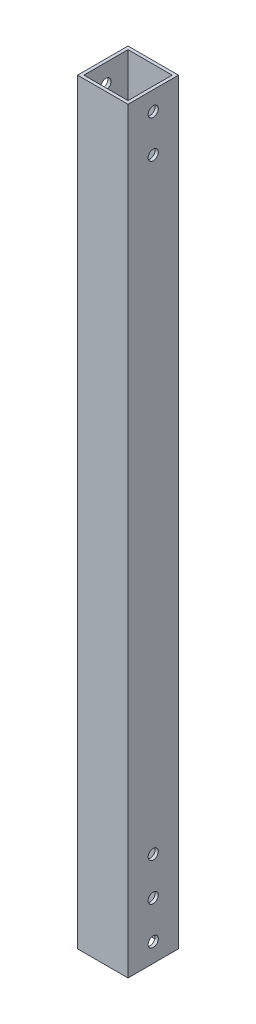
ISO-10303-21;
HEADER;
FILE_DESCRIPTION(('STEP AP214'),'2;1');
FILE_NAME('part.step','',(''),(''),'','','');
FILE_SCHEMA(('AUTOMOTIVE_DESIGN { 1 0 10303 214 1 1 1 1 }'));
ENDSEC;
DATA;
#1=APPLICATION_CONTEXT('core data for automotive mechanical design processes');
#2=APPLICATION_PROTOCOL_DEFINITION('international standard','automotive_design',2000,#1);
#3=PRODUCT_CONTEXT('',#1,'mechanical');
#4=PRODUCT('Part','Part','',(#3));
#5=PRODUCT_RELATED_PRODUCT_CATEGORY('part','',(#4));
#6=PRODUCT_DEFINITION_FORMATION('','',#4);
#7=PRODUCT_DEFINITION_CONTEXT('part definition',#1,'design');
#8=PRODUCT_DEFINITION('design','',#6,#7);
#9=PRODUCT_DEFINITION_SHAPE('','',#8);
#10=(LENGTH_UNIT() NAMED_UNIT(*) SI_UNIT(.MILLI.,.METRE.));
#11=(NAMED_UNIT(*) PLANE_ANGLE_UNIT() SI_UNIT($,.RADIAN.));
#12=(NAMED_UNIT(*) SI_UNIT($,.STERADIAN.) SOLID_ANGLE_UNIT());
#13=UNCERTAINTY_MEASURE_WITH_UNIT(LENGTH_MEASURE(1.E-05),#10,'distance_accuracy_value','');
#14=(GEOMETRIC_REPRESENTATION_CONTEXT(3) GLOBAL_UNCERTAINTY_ASSIGNED_CONTEXT((#13)) GLOBAL_UNIT_ASSIGNED_CONTEXT((#10,
#11,#12)) REPRESENTATION_CONTEXT('',''));
#15=CARTESIAN_POINT('',(0.,0.,0.));
#16=DIRECTION('',(0.,0.,1.));
#17=DIRECTION('',(1.,0.,0.));
#18=AXIS2_PLACEMENT_3D('',#15,#16,#17);
#19=CARTESIAN_POINT('',(12.7,47.625,0.));
#20=DIRECTION('',(-1.,0.,0.));
#21=DIRECTION('',(0.,0.,1.));
#22=AXIS2_PLACEMENT_3D('',#19,#20,#21);
#23=CYLINDRICAL_SURFACE('',#22,2.5527);
#24=CARTESIAN_POINT('',(-11.1125,47.625,0.));
#25=DIRECTION('',(1.,0.,0.));
#26=DIRECTION('',(0.,0.,-1.));
#27=AXIS2_PLACEMENT_3D('',#24,#25,#26);
#28=CIRCLE('',#27,2.5527);
#29=CARTESIAN_POINT('',(-11.1125,47.625,-2.5527));
#30=VERTEX_POINT('',#29);
#31=EDGE_CURVE('E222',#30,#30,#28,.T.);
#32=ORIENTED_EDGE('',*,*,#31,.T.);
#33=EDGE_LOOP('',(#32));
#34=FACE_BOUND('',#33,.T.);
#35=CARTESIAN_POINT('',(-12.7,47.625,0.));
#36=DIRECTION('',(-1.,0.,0.));
#37=DIRECTION('',(0.,0.,1.));
#38=AXIS2_PLACEMENT_3D('',#35,#36,#37);
#39=CIRCLE('',#38,2.5527);
#40=CARTESIAN_POINT('',(-12.7,47.625,2.5527));
#41=VERTEX_POINT('',#40);
#42=EDGE_CURVE('E198',#41,#41,#39,.T.);
#43=ORIENTED_EDGE('',*,*,#42,.T.);
#44=EDGE_LOOP('',(#43));
#45=FACE_BOUND('',#44,.T.);
#46=ADVANCED_FACE('F50',(#34,#45),#23,.F.);
#47=CARTESIAN_POINT('',(12.7,47.625,0.));
#48=DIRECTION('',(-1.,0.,0.));
#49=DIRECTION('',(0.,0.,1.));
#50=AXIS2_PLACEMENT_3D('',#47,#48,#49);
#51=CYLINDRICAL_SURFACE('',#50,2.5527);
#52=CARTESIAN_POINT('',(11.1125,47.625,0.));
#53=DIRECTION('',(-1.,0.,0.));
#54=DIRECTION('',(0.,0.,1.));
#55=AXIS2_PLACEMENT_3D('',#52,#53,#54);
#56=CIRCLE('',#55,2.5527);
#57=CARTESIAN_POINT('',(11.1125,47.625,2.5527));
#58=VERTEX_POINT('',#57);
#59=EDGE_CURVE('E233',#58,#58,#56,.T.);
#60=ORIENTED_EDGE('',*,*,#59,.T.);
#61=EDGE_LOOP('',(#60));
#62=FACE_BOUND('',#61,.T.);
#63=CARTESIAN_POINT('',(12.7,47.625,0.));
#64=DIRECTION('',(-1.,0.,0.));
#65=DIRECTION('',(0.,0.,1.));
#66=AXIS2_PLACEMENT_3D('',#63,#64,#65);
#67=CIRCLE('',#66,2.5527);
#68=CARTESIAN_POINT('',(12.7,47.625,2.5527));
#69=VERTEX_POINT('',#68);
#70=EDGE_CURVE('E374',#69,#69,#67,.T.);
#71=ORIENTED_EDGE('',*,*,#70,.F.);
#72=EDGE_LOOP('',(#71));
#73=FACE_BOUND('',#72,.T.);
#74=ADVANCED_FACE('F52',(#62,#73),#51,.F.);
#75=CARTESIAN_POINT('',(12.7,28.575,0.));
#76=DIRECTION('',(-1.,0.,0.));
#77=DIRECTION('',(0.,0.,1.));
#78=AXIS2_PLACEMENT_3D('',#75,#76,#77);
#79=CYLINDRICAL_SURFACE('',#78,2.5527);
#80=CARTESIAN_POINT('',(-11.1125,28.575,0.));
#81=DIRECTION('',(1.,0.,0.));
#82=DIRECTION('',(0.,0.,-1.));
#83=AXIS2_PLACEMENT_3D('',#80,#81,#82);
#84=CIRCLE('',#83,2.5527);
#85=CARTESIAN_POINT('',(-11.1125,28.575,-2.5527));
#86=VERTEX_POINT('',#85);
#87=EDGE_CURVE('E225',#86,#86,#84,.T.);
#88=ORIENTED_EDGE('',*,*,#87,.T.);
#89=EDGE_LOOP('',(#88));
#90=FACE_BOUND('',#89,.T.);
#91=CARTESIAN_POINT('',(-12.7,28.575,0.));
#92=DIRECTION('',(-1.,0.,0.));
#93=DIRECTION('',(0.,0.,1.));
#94=AXIS2_PLACEMENT_3D('',#91,#92,#93);
#95=CIRCLE('',#94,2.5527);
#96=CARTESIAN_POINT('',(-12.7,28.575,2.5527));
#97=VERTEX_POINT('',#96);
#98=EDGE_CURVE('E212',#97,#97,#95,.T.);
#99=ORIENTED_EDGE('',*,*,#98,.T.);
#100=EDGE_LOOP('',(#99));
#101=FACE_BOUND('',#100,.T.);
#102=ADVANCED_FACE('F275',(#90,#101),#79,.F.);
#103=CARTESIAN_POINT('',(12.7,9.525,0.));
#104=DIRECTION('',(-1.,0.,0.));
#105=DIRECTION('',(0.,0.,1.));
#106=AXIS2_PLACEMENT_3D('',#103,#104,#105);
#107=CYLINDRICAL_SURFACE('',#106,2.5527);
#108=CARTESIAN_POINT('',(-11.1125,9.525,0.));
#109=DIRECTION('',(1.,0.,0.));
#110=DIRECTION('',(0.,0.,-1.));
#111=AXIS2_PLACEMENT_3D('',#108,#109,#110);
#112=CIRCLE('',#111,2.5527);
#113=CARTESIAN_POINT('',(-11.1125,9.525,-2.5527));
#114=VERTEX_POINT('',#113);
#115=EDGE_CURVE('E228',#114,#114,#112,.T.);
#116=ORIENTED_EDGE('',*,*,#115,.T.);
#117=EDGE_LOOP('',(#116));
#118=FACE_BOUND('',#117,.T.);
#119=CARTESIAN_POINT('',(-12.7,9.525,0.));
#120=DIRECTION('',(-1.,0.,0.));
#121=DIRECTION('',(0.,0.,1.));
#122=AXIS2_PLACEMENT_3D('',#119,#120,#121);
#123=CIRCLE('',#122,2.5527);
#124=CARTESIAN_POINT('',(-12.7,9.525,2.5527));
#125=VERTEX_POINT('',#124);
#126=EDGE_CURVE('E215',#125,#125,#123,.T.);
#127=ORIENTED_EDGE('',*,*,#126,.T.);
#128=EDGE_LOOP('',(#127));
#129=FACE_BOUND('',#128,.T.);
#130=ADVANCED_FACE('F283',(#118,#129),#107,.F.);
#131=CARTESIAN_POINT('',(12.7,28.575,0.));
#132=DIRECTION('',(-1.,0.,0.));
#133=DIRECTION('',(0.,0.,1.));
#134=AXIS2_PLACEMENT_3D('',#131,#132,#133);
#135=CYLINDRICAL_SURFACE('',#134,2.5527);
#136=CARTESIAN_POINT('',(11.1125,28.575,0.));
#137=DIRECTION('',(-1.,0.,0.));
#138=DIRECTION('',(0.,0.,1.));
#139=AXIS2_PLACEMENT_3D('',#136,#137,#138);
#140=CIRCLE('',#139,2.5527);
#141=CARTESIAN_POINT('',(11.1125,28.575,2.5527));
#142=VERTEX_POINT('',#141);
#143=EDGE_CURVE('E54',#142,#142,#140,.T.);
#144=ORIENTED_EDGE('',*,*,#143,.T.);
#145=EDGE_LOOP('',(#144));
#146=FACE_BOUND('',#145,.T.);
#147=CARTESIAN_POINT('',(12.7,28.575,0.));
#148=DIRECTION('',(-1.,0.,0.));
#149=DIRECTION('',(0.,0.,1.));
#150=AXIS2_PLACEMENT_3D('',#147,#148,#149);
#151=CIRCLE('',#150,2.5527);
#152=CARTESIAN_POINT('',(12.7,28.575,2.5527));
#153=VERTEX_POINT('',#152);
#154=EDGE_CURVE('E201',#153,#153,#151,.T.);
#155=ORIENTED_EDGE('',*,*,#154,.F.);
#156=EDGE_LOOP('',(#155));
#157=FACE_BOUND('',#156,.T.);
#158=ADVANCED_FACE('F244',(#146,#157),#135,.F.);
#159=CARTESIAN_POINT('',(12.7,9.525,0.));
#160=DIRECTION('',(-1.,0.,0.));
#161=DIRECTION('',(0.,0.,1.));
#162=AXIS2_PLACEMENT_3D('',#159,#160,#161);
#163=CYLINDRICAL_SURFACE('',#162,2.5527);
#164=CARTESIAN_POINT('',(11.1125,9.525,0.));
#165=DIRECTION('',(-1.,0.,0.));
#166=DIRECTION('',(0.,0.,1.));
#167=AXIS2_PLACEMENT_3D('',#164,#165,#166);
#168=CIRCLE('',#167,2.5527);
#169=CARTESIAN_POINT('',(11.1125,9.525,2.5527));
#170=VERTEX_POINT('',#169);
#171=EDGE_CURVE('E11',#170,#170,#168,.T.);
#172=ORIENTED_EDGE('',*,*,#171,.T.);
#173=EDGE_LOOP('',(#172));
#174=FACE_BOUND('',#173,.T.);
#175=CARTESIAN_POINT('',(12.7,9.525,0.));
#176=DIRECTION('',(-1.,0.,0.));
#177=DIRECTION('',(0.,0.,1.));
#178=AXIS2_PLACEMENT_3D('',#175,#176,#177);
#179=CIRCLE('',#178,2.5527);
#180=CARTESIAN_POINT('',(12.7,9.525,2.5527));
#181=VERTEX_POINT('',#180);
#182=EDGE_CURVE('E192',#181,#181,#179,.T.);
#183=ORIENTED_EDGE('',*,*,#182,.F.);
#184=EDGE_LOOP('',(#183));
#185=FACE_BOUND('',#184,.T.);
#186=ADVANCED_FACE('F251',(#174,#185),#163,.F.);
#187=CARTESIAN_POINT('',(11.1125,762.,-11.1125));
#188=DIRECTION('',(-1.,0.,0.));
#189=DIRECTION('',(0.,1.,0.));
#190=AXIS2_PLACEMENT_3D('',#187,#188,#189);
#191=PLANE('',#190);
#192=CARTESIAN_POINT('',(11.1125,371.475,0.));
#193=DIRECTION('',(-1.,0.,0.));
#194=DIRECTION('',(0.,0.,1.));
#195=AXIS2_PLACEMENT_3D('',#192,#193,#194);
#196=CIRCLE('',#195,2.55269999999997);
#197=CARTESIAN_POINT('',(11.1125,371.475,2.55269999999997));
#198=VERTEX_POINT('',#197);
#199=EDGE_CURVE('E403',#198,#198,#196,.T.);
#200=ORIENTED_EDGE('',*,*,#199,.F.);
#201=EDGE_LOOP('',(#200));
#202=FACE_BOUND('',#201,.T.);
#203=CARTESIAN_POINT('',(11.1125,352.552,0.));
#204=DIRECTION('',(-1.,0.,0.));
#205=DIRECTION('',(0.,0.,1.));
#206=AXIS2_PLACEMENT_3D('',#203,#204,#205);
#207=CIRCLE('',#206,2.55269999999997);
#208=CARTESIAN_POINT('',(11.1125,352.552,2.55269999999997));
#209=VERTEX_POINT('',#208);
#210=EDGE_CURVE('E408',#209,#209,#207,.T.);
#211=ORIENTED_EDGE('',*,*,#210,.F.);
#212=EDGE_LOOP('',(#211));
#213=FACE_BOUND('',#212,.T.);
#214=DIRECTION('',(0.,0.,1.));
#215=VECTOR('',#214,1.);
#216=CARTESIAN_POINT('',(11.1125,381.,-11.1125));
#217=LINE('',#216,#215);
#218=CARTESIAN_POINT('',(11.1125,381.,-11.1125));
#219=VERTEX_POINT('',#218);
#220=CARTESIAN_POINT('',(11.1125,381.,11.1125));
#221=VERTEX_POINT('',#220);
#222=EDGE_CURVE('E397',#219,#221,#217,.T.);
#223=ORIENTED_EDGE('',*,*,#222,.F.);
#224=DIRECTION('',(0.,-1.,0.));
#225=VECTOR('',#224,1.);
#226=CARTESIAN_POINT('',(11.1125,762.,-11.1125));
#227=LINE('',#226,#225);
#228=CARTESIAN_POINT('',(11.1125,0.,-11.1125));
#229=VERTEX_POINT('',#228);
#230=EDGE_CURVE('E209',#219,#229,#227,.T.);
#231=ORIENTED_EDGE('',*,*,#230,.T.);
#232=DIRECTION('',(0.,0.,-1.));
#233=VECTOR('',#232,1.);
#234=CARTESIAN_POINT('',(11.1125,0.,-11.1125));
#235=LINE('',#234,#233);
#236=CARTESIAN_POINT('',(11.1125,0.,11.1125));
#237=VERTEX_POINT('',#236);
#238=EDGE_CURVE('E350',#237,#229,#235,.T.);
#239=ORIENTED_EDGE('',*,*,#238,.F.);
#240=DIRECTION('',(0.,-1.,0.));
#241=VECTOR('',#240,1.);
#242=CARTESIAN_POINT('',(11.1125,762.,11.1125));
#243=LINE('',#242,#241);
#244=EDGE_CURVE('E231',#221,#237,#243,.T.);
#245=ORIENTED_EDGE('',*,*,#244,.F.);
#246=EDGE_LOOP('',(#223,#231,#239,#245));
#247=FACE_BOUND('',#246,.T.);
#248=ORIENTED_EDGE('',*,*,#171,.F.);
#249=EDGE_LOOP('',(#248));
#250=FACE_BOUND('',#249,.T.);
#251=ORIENTED_EDGE('',*,*,#143,.F.);
#252=EDGE_LOOP('',(#251));
#253=FACE_BOUND('',#252,.T.);
#254=ORIENTED_EDGE('',*,*,#59,.F.);
#255=EDGE_LOOP('',(#254));
#256=FACE_BOUND('',#255,.T.);
#257=ADVANCED_FACE('F247',(#202,#213,#247,#250,#253,#256),#191,.T.);
#258=CARTESIAN_POINT('',(-11.1125,762.,11.1125));
#259=DIRECTION('',(0.,0.,-1.));
#260=DIRECTION('',(0.,-1.,0.));
#261=AXIS2_PLACEMENT_3D('',#258,#259,#260);
#262=PLANE('',#261);
#263=DIRECTION('',(-1.,0.,0.));
#264=VECTOR('',#263,1.);
#265=CARTESIAN_POINT('',(-11.1125,381.,11.1125));
#266=LINE('',#265,#264);
#267=CARTESIAN_POINT('',(-11.1125,381.,11.1125));
#268=VERTEX_POINT('',#267);
#269=EDGE_CURVE('E338',#221,#268,#266,.T.);
#270=ORIENTED_EDGE('',*,*,#269,.F.);
#271=ORIENTED_EDGE('',*,*,#244,.T.);
#272=DIRECTION('',(1.,0.,0.));
#273=VECTOR('',#272,1.);
#274=CARTESIAN_POINT('',(-11.1125,0.,11.1125));
#275=LINE('',#274,#273);
#276=CARTESIAN_POINT('',(-11.1125,0.,11.1125));
#277=VERTEX_POINT('',#276);
#278=EDGE_CURVE('E344',#277,#237,#275,.T.);
#279=ORIENTED_EDGE('',*,*,#278,.F.);
#280=DIRECTION('',(0.,-1.,0.));
#281=VECTOR('',#280,1.);
#282=CARTESIAN_POINT('',(-11.1125,762.,11.1125));
#283=LINE('',#282,#281);
#284=EDGE_CURVE('E208',#268,#277,#283,.T.);
#285=ORIENTED_EDGE('',*,*,#284,.F.);
#286=EDGE_LOOP('',(#270,#271,#279,#285));
#287=FACE_BOUND('',#286,.T.);
#288=ADVANCED_FACE('F250',(#287),#262,.T.);
#289=CARTESIAN_POINT('',(-11.1125,762.,-11.1125));
#290=DIRECTION('',(1.,0.,0.));
#291=DIRECTION('',(0.,0.,-1.));
#292=AXIS2_PLACEMENT_3D('',#289,#290,#291);
#293=PLANE('',#292);
#294=CARTESIAN_POINT('',(-11.1125,371.475,0.));
#295=DIRECTION('',(1.,0.,0.));
#296=DIRECTION('',(0.,0.,-1.));
#297=AXIS2_PLACEMENT_3D('',#294,#295,#296);
#298=CIRCLE('',#297,2.55269999999997);
#299=CARTESIAN_POINT('',(-11.1125,371.475,-2.55269999999997));
#300=VERTEX_POINT('',#299);
#301=EDGE_CURVE('E324',#300,#300,#298,.T.);
#302=ORIENTED_EDGE('',*,*,#301,.F.);
#303=EDGE_LOOP('',(#302));
#304=FACE_BOUND('',#303,.T.);
#305=CARTESIAN_POINT('',(-11.1125,352.552,0.));
#306=DIRECTION('',(1.,0.,0.));
#307=DIRECTION('',(0.,0.,-1.));
#308=AXIS2_PLACEMENT_3D('',#305,#306,#307);
#309=CIRCLE('',#308,2.55269999999997);
#310=CARTESIAN_POINT('',(-11.1125,352.552,-2.55269999999997));
#311=VERTEX_POINT('',#310);
#312=EDGE_CURVE('E328',#311,#311,#309,.T.);
#313=ORIENTED_EDGE('',*,*,#312,.F.);
#314=EDGE_LOOP('',(#313));
#315=FACE_BOUND('',#314,.T.);
#316=DIRECTION('',(0.,0.,-1.));
#317=VECTOR('',#316,1.);
#318=CARTESIAN_POINT('',(-11.1125,381.,-11.1125));
#319=LINE('',#318,#317);
#320=CARTESIAN_POINT('',(-11.1125,381.,-11.1125));
#321=VERTEX_POINT('',#320);
#322=EDGE_CURVE('E67',#268,#321,#319,.T.);
#323=ORIENTED_EDGE('',*,*,#322,.F.);
#324=ORIENTED_EDGE('',*,*,#284,.T.);
#325=DIRECTION('',(0.,0.,1.));
#326=VECTOR('',#325,1.);
#327=CARTESIAN_POINT('',(-11.1125,0.,-11.1125));
#328=LINE('',#327,#326);
#329=CARTESIAN_POINT('',(-11.1125,0.,-11.1125));
#330=VERTEX_POINT('',#329);
#331=EDGE_CURVE('E351',#330,#277,#328,.T.);
#332=ORIENTED_EDGE('',*,*,#331,.F.);
#333=DIRECTION('',(0.,-1.,0.));
#334=VECTOR('',#333,1.);
#335=CARTESIAN_POINT('',(-11.1125,762.,-11.1125));
#336=LINE('',#335,#334);
#337=EDGE_CURVE('E205',#321,#330,#336,.T.);
#338=ORIENTED_EDGE('',*,*,#337,.F.);
#339=EDGE_LOOP('',(#323,#324,#332,#338));
#340=FACE_BOUND('',#339,.T.);
#341=ORIENTED_EDGE('',*,*,#115,.F.);
#342=EDGE_LOOP('',(#341));
#343=FACE_BOUND('',#342,.T.);
#344=ORIENTED_EDGE('',*,*,#87,.F.);
#345=EDGE_LOOP('',(#344));
#346=FACE_BOUND('',#345,.T.);
#347=ORIENTED_EDGE('',*,*,#31,.F.);
#348=EDGE_LOOP('',(#347));
#349=FACE_BOUND('',#348,.T.);
#350=ADVANCED_FACE('F259',(#304,#315,#340,#343,#346,#349),#293,.T.);
#351=CARTESIAN_POINT('',(-11.1125,762.,-11.1125));
#352=DIRECTION('',(0.,0.,1.));
#353=DIRECTION('',(1.,0.,0.));
#354=AXIS2_PLACEMENT_3D('',#351,#352,#353);
#355=PLANE('',#354);
#356=DIRECTION('',(1.,0.,0.));
#357=VECTOR('',#356,1.);
#358=CARTESIAN_POINT('',(-11.1125,381.,-11.1125));
#359=LINE('',#358,#357);
#360=EDGE_CURVE('E339',#321,#219,#359,.T.);
#361=ORIENTED_EDGE('',*,*,#360,.F.);
#362=ORIENTED_EDGE('',*,*,#337,.T.);
#363=DIRECTION('',(-1.,0.,0.));
#364=VECTOR('',#363,1.);
#365=CARTESIAN_POINT('',(-11.1125,0.,-11.1125));
#366=LINE('',#365,#364);
#367=EDGE_CURVE('E356',#229,#330,#366,.T.);
#368=ORIENTED_EDGE('',*,*,#367,.F.);
#369=ORIENTED_EDGE('',*,*,#230,.F.);
#370=EDGE_LOOP('',(#361,#362,#368,#369));
#371=FACE_BOUND('',#370,.T.);
#372=ADVANCED_FACE('F309',(#371),#355,.T.);
#373=CARTESIAN_POINT('',(-12.7,762.,12.7));
#374=DIRECTION('',(0.,0.,-1.));
#375=DIRECTION('',(0.,-1.,0.));
#376=AXIS2_PLACEMENT_3D('',#373,#374,#375);
#377=PLANE('',#376);
#378=DIRECTION('',(0.,-1.,0.));
#379=VECTOR('',#378,1.);
#380=CARTESIAN_POINT('',(12.7,762.,12.7));
#381=LINE('',#380,#379);
#382=CARTESIAN_POINT('',(12.7,381.,12.7));
#383=VERTEX_POINT('',#382);
#384=CARTESIAN_POINT('',(12.7,0.,12.7));
#385=VERTEX_POINT('',#384);
#386=EDGE_CURVE('E372',#383,#385,#381,.T.);
#387=ORIENTED_EDGE('',*,*,#386,.F.);
#388=DIRECTION('',(1.,0.,0.));
#389=VECTOR('',#388,1.);
#390=CARTESIAN_POINT('',(-12.7,381.,12.7));
#391=LINE('',#390,#389);
#392=CARTESIAN_POINT('',(-12.7,381.,12.7));
#393=VERTEX_POINT('',#392);
#394=EDGE_CURVE('E75',#393,#383,#391,.T.);
#395=ORIENTED_EDGE('',*,*,#394,.F.);
#396=DIRECTION('',(0.,-1.,0.));
#397=VECTOR('',#396,1.);
#398=CARTESIAN_POINT('',(-12.7,762.,12.7));
#399=LINE('',#398,#397);
#400=CARTESIAN_POINT('',(-12.7,0.,12.7));
#401=VERTEX_POINT('',#400);
#402=EDGE_CURVE('E185',#393,#401,#399,.T.);
#403=ORIENTED_EDGE('',*,*,#402,.T.);
#404=DIRECTION('',(1.,0.,0.));
#405=VECTOR('',#404,1.);
#406=CARTESIAN_POINT('',(-12.7,0.,12.7));
#407=LINE('',#406,#405);
#408=EDGE_CURVE('E364',#401,#385,#407,.T.);
#409=ORIENTED_EDGE('',*,*,#408,.T.);
#410=EDGE_LOOP('',(#387,#395,#403,#409));
#411=FACE_BOUND('',#410,.T.);
#412=ADVANCED_FACE('F298',(#411),#377,.F.);
#413=CARTESIAN_POINT('',(-12.7,762.,-12.7));
#414=DIRECTION('',(1.,0.,0.));
#415=DIRECTION('',(0.,0.,-1.));
#416=AXIS2_PLACEMENT_3D('',#413,#414,#415);
#417=PLANE('',#416);
#418=CARTESIAN_POINT('',(-12.7,371.475,0.));
#419=DIRECTION('',(1.,0.,0.));
#420=DIRECTION('',(0.,0.,-1.));
#421=AXIS2_PLACEMENT_3D('',#418,#419,#420);
#422=CIRCLE('',#421,2.55269999999997);
#423=CARTESIAN_POINT('',(-12.7,371.475,-2.55269999999997));
#424=VERTEX_POINT('',#423);
#425=EDGE_CURVE('E412',#424,#424,#422,.T.);
#426=ORIENTED_EDGE('',*,*,#425,.T.);
#427=EDGE_LOOP('',(#426));
#428=FACE_BOUND('',#427,.T.);
#429=CARTESIAN_POINT('',(-12.7,352.552,0.));
#430=DIRECTION('',(1.,0.,0.));
#431=DIRECTION('',(0.,0.,-1.));
#432=AXIS2_PLACEMENT_3D('',#429,#430,#431);
#433=CIRCLE('',#432,2.55269999999997);
#434=CARTESIAN_POINT('',(-12.7,352.552,-2.55269999999997));
#435=VERTEX_POINT('',#434);
#436=EDGE_CURVE('E413',#435,#435,#433,.T.);
#437=ORIENTED_EDGE('',*,*,#436,.T.);
#438=EDGE_LOOP('',(#437));
#439=FACE_BOUND('',#438,.T.);
#440=ORIENTED_EDGE('',*,*,#126,.F.);
#441=EDGE_LOOP('',(#440));
#442=FACE_BOUND('',#441,.T.);
#443=ORIENTED_EDGE('',*,*,#98,.F.);
#444=EDGE_LOOP('',(#443));
#445=FACE_BOUND('',#444,.T.);
#446=ORIENTED_EDGE('',*,*,#42,.F.);
#447=EDGE_LOOP('',(#446));
#448=FACE_BOUND('',#447,.T.);
#449=ORIENTED_EDGE('',*,*,#402,.F.);
#450=DIRECTION('',(0.,0.,1.));
#451=VECTOR('',#450,1.);
#452=CARTESIAN_POINT('',(-12.7,381.,-12.7));
#453=LINE('',#452,#451);
#454=CARTESIAN_POINT('',(-12.7,381.,-12.7));
#455=VERTEX_POINT('',#454);
#456=EDGE_CURVE('E173',#455,#393,#453,.T.);
#457=ORIENTED_EDGE('',*,*,#456,.F.);
#458=DIRECTION('',(0.,-1.,0.));
#459=VECTOR('',#458,1.);
#460=CARTESIAN_POINT('',(-12.7,762.,-12.7));
#461=LINE('',#460,#459);
#462=CARTESIAN_POINT('',(-12.7,0.,-12.7));
#463=VERTEX_POINT('',#462);
#464=EDGE_CURVE('E183',#455,#463,#461,.T.);
#465=ORIENTED_EDGE('',*,*,#464,.T.);
#466=DIRECTION('',(0.,0.,1.));
#467=VECTOR('',#466,1.);
#468=CARTESIAN_POINT('',(-12.7,0.,-12.7));
#469=LINE('',#468,#467);
#470=EDGE_CURVE('E389',#463,#401,#469,.T.);
#471=ORIENTED_EDGE('',*,*,#470,.T.);
#472=EDGE_LOOP('',(#449,#457,#465,#471));
#473=FACE_BOUND('',#472,.T.);
#474=ADVANCED_FACE('F181',(#428,#439,#442,#445,#448,#473),#417,.F.);
#475=CARTESIAN_POINT('',(-12.7,762.,-12.7));
#476=DIRECTION('',(0.,0.,1.));
#477=DIRECTION('',(1.,0.,0.));
#478=AXIS2_PLACEMENT_3D('',#475,#476,#477);
#479=PLANE('',#478);
#480=ORIENTED_EDGE('',*,*,#464,.F.);
#481=DIRECTION('',(1.,0.,0.));
#482=VECTOR('',#481,1.);
#483=CARTESIAN_POINT('',(-12.7,381.,-12.7));
#484=LINE('',#483,#482);
#485=CARTESIAN_POINT('',(12.7,381.,-12.7));
#486=VERTEX_POINT('',#485);
#487=EDGE_CURVE('E170',#455,#486,#484,.T.);
#488=ORIENTED_EDGE('',*,*,#487,.T.);
#489=DIRECTION('',(0.,-1.,0.));
#490=VECTOR('',#489,1.);
#491=CARTESIAN_POINT('',(12.7,762.,-12.7));
#492=LINE('',#491,#490);
#493=CARTESIAN_POINT('',(12.7,0.,-12.7));
#494=VERTEX_POINT('',#493);
#495=EDGE_CURVE('E369',#486,#494,#492,.T.);
#496=ORIENTED_EDGE('',*,*,#495,.T.);
#497=DIRECTION('',(-1.,0.,0.));
#498=VECTOR('',#497,1.);
#499=CARTESIAN_POINT('',(-12.7,0.,-12.7));
#500=LINE('',#499,#498);
#501=EDGE_CURVE('E189',#494,#463,#500,.T.);
#502=ORIENTED_EDGE('',*,*,#501,.T.);
#503=EDGE_LOOP('',(#480,#488,#496,#502));
#504=FACE_BOUND('',#503,.T.);
#505=ADVANCED_FACE('F187',(#504),#479,.F.);
#506=CARTESIAN_POINT('',(12.7,762.,-12.7));
#507=DIRECTION('',(-1.,0.,0.));
#508=DIRECTION('',(0.,0.,1.));
#509=AXIS2_PLACEMENT_3D('',#506,#507,#508);
#510=PLANE('',#509);
#511=CARTESIAN_POINT('',(12.7,371.475,0.));
#512=DIRECTION('',(1.,0.,0.));
#513=DIRECTION('',(0.,0.,-1.));
#514=AXIS2_PLACEMENT_3D('',#511,#512,#513);
#515=CIRCLE('',#514,2.55269999999997);
#516=CARTESIAN_POINT('',(12.7,371.475,-2.55269999999997));
#517=VERTEX_POINT('',#516);
#518=EDGE_CURVE('E419',#517,#517,#515,.T.);
#519=ORIENTED_EDGE('',*,*,#518,.F.);
#520=EDGE_LOOP('',(#519));
#521=FACE_BOUND('',#520,.T.);
#522=CARTESIAN_POINT('',(12.7,352.552,0.));
#523=DIRECTION('',(1.,0.,0.));
#524=DIRECTION('',(0.,0.,-1.));
#525=AXIS2_PLACEMENT_3D('',#522,#523,#524);
#526=CIRCLE('',#525,2.55269999999997);
#527=CARTESIAN_POINT('',(12.7,352.552,-2.55269999999997));
#528=VERTEX_POINT('',#527);
#529=EDGE_CURVE('E416',#528,#528,#526,.T.);
#530=ORIENTED_EDGE('',*,*,#529,.F.);
#531=EDGE_LOOP('',(#530));
#532=FACE_BOUND('',#531,.T.);
#533=ORIENTED_EDGE('',*,*,#182,.T.);
#534=EDGE_LOOP('',(#533));
#535=FACE_BOUND('',#534,.T.);
#536=ORIENTED_EDGE('',*,*,#154,.T.);
#537=EDGE_LOOP('',(#536));
#538=FACE_BOUND('',#537,.T.);
#539=ORIENTED_EDGE('',*,*,#70,.T.);
#540=EDGE_LOOP('',(#539));
#541=FACE_BOUND('',#540,.T.);
#542=ORIENTED_EDGE('',*,*,#495,.F.);
#543=DIRECTION('',(0.,0.,1.));
#544=VECTOR('',#543,1.);
#545=CARTESIAN_POINT('',(12.7,381.,-12.7));
#546=LINE('',#545,#544);
#547=EDGE_CURVE('E174',#486,#383,#546,.T.);
#548=ORIENTED_EDGE('',*,*,#547,.T.);
#549=ORIENTED_EDGE('',*,*,#386,.T.);
#550=DIRECTION('',(0.,0.,-1.));
#551=VECTOR('',#550,1.);
#552=CARTESIAN_POINT('',(12.7,0.,-12.7));
#553=LINE('',#552,#551);
#554=EDGE_CURVE('E387',#385,#494,#553,.T.);
#555=ORIENTED_EDGE('',*,*,#554,.T.);
#556=EDGE_LOOP('',(#542,#548,#549,#555));
#557=FACE_BOUND('',#556,.T.);
#558=ADVANCED_FACE('F280',(#521,#532,#535,#538,#541,#557),#510,.F.);
#559=CARTESIAN_POINT('',(0.,0.,0.));
#560=DIRECTION('',(0.,1.,0.));
#561=DIRECTION('',(1.,0.,0.));
#562=AXIS2_PLACEMENT_3D('',#559,#560,#561);
#563=PLANE('',#562);
#564=ORIENTED_EDGE('',*,*,#367,.T.);
#565=ORIENTED_EDGE('',*,*,#331,.T.);
#566=ORIENTED_EDGE('',*,*,#278,.T.);
#567=ORIENTED_EDGE('',*,*,#238,.T.);
#568=EDGE_LOOP('',(#564,#565,#566,#567));
#569=FACE_BOUND('',#568,.T.);
#570=ORIENTED_EDGE('',*,*,#554,.F.);
#571=ORIENTED_EDGE('',*,*,#408,.F.);
#572=ORIENTED_EDGE('',*,*,#470,.F.);
#573=ORIENTED_EDGE('',*,*,#501,.F.);
#574=EDGE_LOOP('',(#570,#571,#572,#573));
#575=FACE_BOUND('',#574,.T.);
#576=ADVANCED_FACE('F279',(#569,#575),#563,.F.);
#577=CARTESIAN_POINT('',(-12.7,381.,-12.7));
#578=DIRECTION('',(0.,-1.,0.));
#579=DIRECTION('',(0.,0.,-1.));
#580=AXIS2_PLACEMENT_3D('',#577,#578,#579);
#581=PLANE('',#580);
#582=ORIENTED_EDGE('',*,*,#222,.T.);
#583=ORIENTED_EDGE('',*,*,#269,.T.);
#584=ORIENTED_EDGE('',*,*,#322,.T.);
#585=ORIENTED_EDGE('',*,*,#360,.T.);
#586=EDGE_LOOP('',(#582,#583,#584,#585));
#587=FACE_BOUND('',#586,.T.);
#588=ORIENTED_EDGE('',*,*,#394,.T.);
#589=ORIENTED_EDGE('',*,*,#547,.F.);
#590=ORIENTED_EDGE('',*,*,#487,.F.);
#591=ORIENTED_EDGE('',*,*,#456,.T.);
#592=EDGE_LOOP('',(#588,#589,#590,#591));
#593=FACE_BOUND('',#592,.T.);
#594=ADVANCED_FACE('F172',(#587,#593),#581,.F.);
#595=CARTESIAN_POINT('',(-12.7,352.552,0.));
#596=DIRECTION('',(1.,0.,0.));
#597=DIRECTION('',(0.,0.,-1.));
#598=AXIS2_PLACEMENT_3D('',#595,#596,#597);
#599=CYLINDRICAL_SURFACE('',#598,2.55269999999997);
#600=ORIENTED_EDGE('',*,*,#210,.T.);
#601=EDGE_LOOP('',(#600));
#602=FACE_BOUND('',#601,.T.);
#603=ORIENTED_EDGE('',*,*,#529,.T.);
#604=EDGE_LOOP('',(#603));
#605=FACE_BOUND('',#604,.T.);
#606=ADVANCED_FACE('F435',(#602,#605),#599,.F.);
#607=CARTESIAN_POINT('',(-12.7,371.475,0.));
#608=DIRECTION('',(1.,0.,0.));
#609=DIRECTION('',(0.,0.,-1.));
#610=AXIS2_PLACEMENT_3D('',#607,#608,#609);
#611=CYLINDRICAL_SURFACE('',#610,2.55269999999997);
#612=ORIENTED_EDGE('',*,*,#199,.T.);
#613=EDGE_LOOP('',(#612));
#614=FACE_BOUND('',#613,.T.);
#615=ORIENTED_EDGE('',*,*,#518,.T.);
#616=EDGE_LOOP('',(#615));
#617=FACE_BOUND('',#616,.T.);
#618=ADVANCED_FACE('F429',(#614,#617),#611,.F.);
#619=ORIENTED_EDGE('',*,*,#312,.T.);
#620=EDGE_LOOP('',(#619));
#621=FACE_BOUND('',#620,.T.);
#622=ORIENTED_EDGE('',*,*,#436,.F.);
#623=EDGE_LOOP('',(#622));
#624=FACE_BOUND('',#623,.T.);
#625=ADVANCED_FACE('F426',(#621,#624),#599,.F.);
#626=ORIENTED_EDGE('',*,*,#301,.T.);
#627=EDGE_LOOP('',(#626));
#628=FACE_BOUND('',#627,.T.);
#629=ORIENTED_EDGE('',*,*,#425,.F.);
#630=EDGE_LOOP('',(#629));
#631=FACE_BOUND('',#630,.T.);
#632=ADVANCED_FACE('F424',(#628,#631),#611,.F.);
#633=CLOSED_SHELL('',(#46,#74,#102,#130,#158,#186,#257,#288,#350,#372,#412,#474,#505,#558,#576,
#594,#606,#618,#625,#632));
#634=MANIFOLD_SOLID_BREP('B2',#633);
#635=ADVANCED_BREP_SHAPE_REPRESENTATION('',(#18,#634),#14);
#636=SHAPE_DEFINITION_REPRESENTATION(#9,#635);
ENDSEC;
END-ISO-10303-21;
